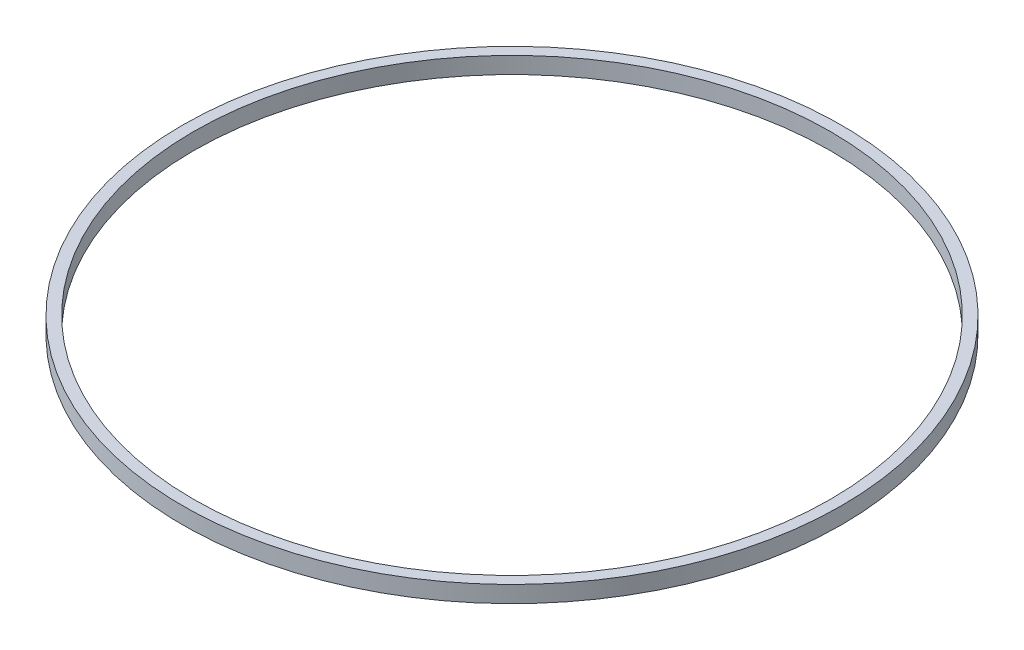
ISO-10303-21;
HEADER;
FILE_DESCRIPTION(('STEP AP214'),'2;1');
FILE_NAME('part.step','',(''),(''),'','','');
FILE_SCHEMA(('AUTOMOTIVE_DESIGN { 1 0 10303 214 1 1 1 1 }'));
ENDSEC;
DATA;
#1=APPLICATION_CONTEXT('core data for automotive mechanical design processes');
#2=APPLICATION_PROTOCOL_DEFINITION('international standard','automotive_design',2000,#1);
#3=PRODUCT_CONTEXT('',#1,'mechanical');
#4=PRODUCT('Part','Part','',(#3));
#5=PRODUCT_RELATED_PRODUCT_CATEGORY('part','',(#4));
#6=PRODUCT_DEFINITION_FORMATION('','',#4);
#7=PRODUCT_DEFINITION_CONTEXT('part definition',#1,'design');
#8=PRODUCT_DEFINITION('design','',#6,#7);
#9=PRODUCT_DEFINITION_SHAPE('','',#8);
#10=(LENGTH_UNIT() NAMED_UNIT(*) SI_UNIT(.MILLI.,.METRE.));
#11=(NAMED_UNIT(*) PLANE_ANGLE_UNIT() SI_UNIT($,.RADIAN.));
#12=(NAMED_UNIT(*) SI_UNIT($,.STERADIAN.) SOLID_ANGLE_UNIT());
#13=UNCERTAINTY_MEASURE_WITH_UNIT(LENGTH_MEASURE(1.E-05),#10,'distance_accuracy_value','');
#14=(GEOMETRIC_REPRESENTATION_CONTEXT(3) GLOBAL_UNCERTAINTY_ASSIGNED_CONTEXT((#13)) GLOBAL_UNIT_ASSIGNED_CONTEXT((#10,
#11,#12)) REPRESENTATION_CONTEXT('',''));
#15=CARTESIAN_POINT('',(0.,0.,0.));
#16=DIRECTION('',(0.,0.,1.));
#17=DIRECTION('',(1.,0.,0.));
#18=AXIS2_PLACEMENT_3D('',#15,#16,#17);
#19=CARTESIAN_POINT('',(0.,3.,0.));
#20=DIRECTION('',(0.,1.,0.));
#21=DIRECTION('',(-1.,0.,0.));
#22=AXIS2_PLACEMENT_3D('',#19,#20,#21);
#23=CYLINDRICAL_SURFACE('',#22,57.5);
#24=CARTESIAN_POINT('',(0.,3.,0.));
#25=DIRECTION('',(0.,1.,0.));
#26=DIRECTION('',(-1.,0.,0.));
#27=AXIS2_PLACEMENT_3D('',#24,#25,#26);
#28=CIRCLE('',#27,57.5);
#29=CARTESIAN_POINT('',(-57.5,2.99999999999999,0.));
#30=VERTEX_POINT('',#29);
#31=EDGE_CURVE('E10',#30,#30,#28,.T.);
#32=ORIENTED_EDGE('',*,*,#31,.T.);
#33=EDGE_LOOP('',(#32));
#34=FACE_BOUND('',#33,.T.);
#35=CARTESIAN_POINT('',(0.,0.,0.));
#36=DIRECTION('',(0.,1.,0.));
#37=DIRECTION('',(-1.,0.,0.));
#38=AXIS2_PLACEMENT_3D('',#35,#36,#37);
#39=CIRCLE('',#38,57.5);
#40=CARTESIAN_POINT('',(-57.5,0.,0.));
#41=VERTEX_POINT('',#40);
#42=EDGE_CURVE('E43',#41,#41,#39,.T.);
#43=ORIENTED_EDGE('',*,*,#42,.F.);
#44=EDGE_LOOP('',(#43));
#45=FACE_BOUND('',#44,.T.);
#46=ADVANCED_FACE('F29',(#34,#45),#23,.F.);
#47=CARTESIAN_POINT('',(-57.5,2.99999999999999,0.));
#48=DIRECTION('',(0.,1.,0.));
#49=DIRECTION('',(-1.,0.,0.));
#50=AXIS2_PLACEMENT_3D('',#47,#48,#49);
#51=PLANE('',#50);
#52=CARTESIAN_POINT('',(0.,3.,0.));
#53=DIRECTION('',(0.,1.,0.));
#54=DIRECTION('',(-1.,0.,0.));
#55=AXIS2_PLACEMENT_3D('',#52,#53,#54);
#56=CIRCLE('',#55,59.5);
#57=CARTESIAN_POINT('',(-59.5,2.99999999999999,0.));
#58=VERTEX_POINT('',#57);
#59=EDGE_CURVE('E35',#58,#58,#56,.T.);
#60=ORIENTED_EDGE('',*,*,#59,.T.);
#61=EDGE_LOOP('',(#60));
#62=FACE_BOUND('',#61,.T.);
#63=ORIENTED_EDGE('',*,*,#31,.F.);
#64=EDGE_LOOP('',(#63));
#65=FACE_BOUND('',#64,.T.);
#66=ADVANCED_FACE('F53',(#62,#65),#51,.T.);
#67=CARTESIAN_POINT('',(0.,3.,0.));
#68=DIRECTION('',(0.,1.,0.));
#69=DIRECTION('',(-1.,0.,0.));
#70=AXIS2_PLACEMENT_3D('',#67,#68,#69);
#71=CYLINDRICAL_SURFACE('',#70,59.5);
#72=CARTESIAN_POINT('',(0.,0.,0.));
#73=DIRECTION('',(0.,1.,0.));
#74=DIRECTION('',(-1.,0.,0.));
#75=AXIS2_PLACEMENT_3D('',#72,#73,#74);
#76=CIRCLE('',#75,59.5);
#77=CARTESIAN_POINT('',(-59.5,0.,0.));
#78=VERTEX_POINT('',#77);
#79=EDGE_CURVE('E39',#78,#78,#76,.T.);
#80=ORIENTED_EDGE('',*,*,#79,.T.);
#81=EDGE_LOOP('',(#80));
#82=FACE_BOUND('',#81,.T.);
#83=ORIENTED_EDGE('',*,*,#59,.F.);
#84=EDGE_LOOP('',(#83));
#85=FACE_BOUND('',#84,.T.);
#86=ADVANCED_FACE('F57',(#82,#85),#71,.T.);
#87=CARTESIAN_POINT('',(-57.5,0.,0.));
#88=DIRECTION('',(0.,-1.,0.));
#89=DIRECTION('',(1.,0.,0.));
#90=AXIS2_PLACEMENT_3D('',#87,#88,#89);
#91=PLANE('',#90);
#92=ORIENTED_EDGE('',*,*,#42,.T.);
#93=EDGE_LOOP('',(#92));
#94=FACE_BOUND('',#93,.T.);
#95=ORIENTED_EDGE('',*,*,#79,.F.);
#96=EDGE_LOOP('',(#95));
#97=FACE_BOUND('',#96,.T.);
#98=ADVANCED_FACE('F49',(#94,#97),#91,.T.);
#99=CLOSED_SHELL('',(#46,#66,#86,#98));
#100=MANIFOLD_SOLID_BREP('B2',#99);
#101=ADVANCED_BREP_SHAPE_REPRESENTATION('',(#18,#100),#14);
#102=SHAPE_DEFINITION_REPRESENTATION(#9,#101);
ENDSEC;
END-ISO-10303-21;
